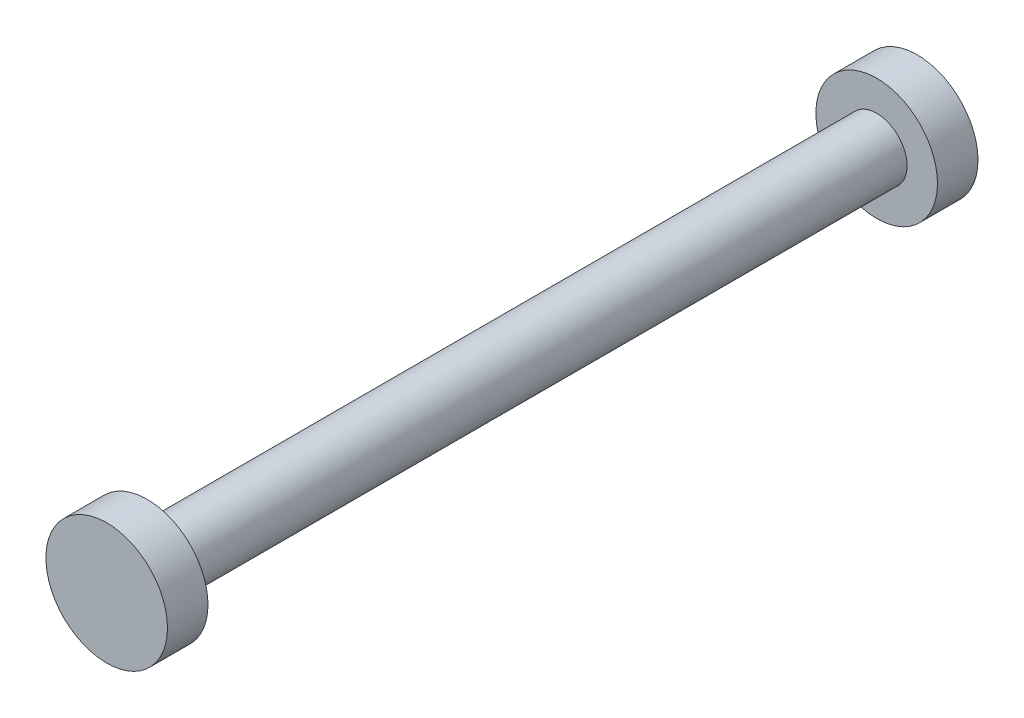
ISO-10303-21;
HEADER;
FILE_DESCRIPTION(('STEP AP214'),'2;1');
FILE_NAME('part.step','',(''),(''),'','','');
FILE_SCHEMA(('AUTOMOTIVE_DESIGN { 1 0 10303 214 1 1 1 1 }'));
ENDSEC;
DATA;
#1=APPLICATION_CONTEXT('core data for automotive mechanical design processes');
#2=APPLICATION_PROTOCOL_DEFINITION('international standard','automotive_design',2000,#1);
#3=PRODUCT_CONTEXT('',#1,'mechanical');
#4=PRODUCT('Part','Part','',(#3));
#5=PRODUCT_RELATED_PRODUCT_CATEGORY('part','',(#4));
#6=PRODUCT_DEFINITION_FORMATION('','',#4);
#7=PRODUCT_DEFINITION_CONTEXT('part definition',#1,'design');
#8=PRODUCT_DEFINITION('design','',#6,#7);
#9=PRODUCT_DEFINITION_SHAPE('','',#8);
#10=(LENGTH_UNIT() NAMED_UNIT(*) SI_UNIT(.MILLI.,.METRE.));
#11=(NAMED_UNIT(*) PLANE_ANGLE_UNIT() SI_UNIT($,.RADIAN.));
#12=(NAMED_UNIT(*) SI_UNIT($,.STERADIAN.) SOLID_ANGLE_UNIT());
#13=UNCERTAINTY_MEASURE_WITH_UNIT(LENGTH_MEASURE(1.E-05),#10,'distance_accuracy_value','');
#14=(GEOMETRIC_REPRESENTATION_CONTEXT(3) GLOBAL_UNCERTAINTY_ASSIGNED_CONTEXT((#13)) GLOBAL_UNIT_ASSIGNED_CONTEXT((#10,
#11,#12)) REPRESENTATION_CONTEXT('',''));
#15=CARTESIAN_POINT('',(0.,0.,0.));
#16=DIRECTION('',(0.,0.,1.));
#17=DIRECTION('',(1.,0.,0.));
#18=AXIS2_PLACEMENT_3D('',#15,#16,#17);
#19=CARTESIAN_POINT('',(0.,0.,45.72));
#20=DIRECTION('',(0.,0.,-1.));
#21=DIRECTION('',(-1.,0.,0.));
#22=AXIS2_PLACEMENT_3D('',#19,#20,#21);
#23=CYLINDRICAL_SURFACE('',#22,1.905);
#24=CARTESIAN_POINT('',(0.,0.,45.72));
#25=DIRECTION('',(0.,0.,1.));
#26=DIRECTION('',(1.,0.,0.));
#27=AXIS2_PLACEMENT_3D('',#24,#25,#26);
#28=CIRCLE('',#27,1.905);
#29=CARTESIAN_POINT('',(1.905,0.,45.72));
#30=VERTEX_POINT('',#29);
#31=EDGE_CURVE('E10',#30,#30,#28,.T.);
#32=ORIENTED_EDGE('',*,*,#31,.F.);
#33=EDGE_LOOP('',(#32));
#34=FACE_BOUND('',#33,.T.);
#35=CARTESIAN_POINT('',(0.,0.,0.));
#36=DIRECTION('',(0.,0.,1.));
#37=DIRECTION('',(1.,0.,0.));
#38=AXIS2_PLACEMENT_3D('',#35,#36,#37);
#39=CIRCLE('',#38,1.905);
#40=CARTESIAN_POINT('',(1.905,0.,0.));
#41=VERTEX_POINT('',#40);
#42=EDGE_CURVE('E40',#41,#41,#39,.T.);
#43=ORIENTED_EDGE('',*,*,#42,.T.);
#44=EDGE_LOOP('',(#43));
#45=FACE_BOUND('',#44,.T.);
#46=ADVANCED_FACE('F37',(#34,#45),#23,.T.);
#47=CARTESIAN_POINT('',(0.,0.,48.26));
#48=DIRECTION('',(0.,0.,-1.));
#49=DIRECTION('',(-1.,0.,0.));
#50=AXIS2_PLACEMENT_3D('',#47,#48,#49);
#51=CYLINDRICAL_SURFACE('',#50,3.81);
#52=CARTESIAN_POINT('',(0.,0.,48.26));
#53=DIRECTION('',(0.,0.,1.));
#54=DIRECTION('',(1.,0.,0.));
#55=AXIS2_PLACEMENT_3D('',#52,#53,#54);
#56=CIRCLE('',#55,3.81);
#57=CARTESIAN_POINT('',(3.81,0.,48.26));
#58=VERTEX_POINT('',#57);
#59=EDGE_CURVE('E45',#58,#58,#56,.T.);
#60=ORIENTED_EDGE('',*,*,#59,.F.);
#61=EDGE_LOOP('',(#60));
#62=FACE_BOUND('',#61,.T.);
#63=CARTESIAN_POINT('',(0.,0.,45.72));
#64=DIRECTION('',(0.,0.,1.));
#65=DIRECTION('',(1.,0.,0.));
#66=AXIS2_PLACEMENT_3D('',#63,#64,#65);
#67=CIRCLE('',#66,3.81);
#68=CARTESIAN_POINT('',(3.81,0.,45.72));
#69=VERTEX_POINT('',#68);
#70=EDGE_CURVE('E50',#69,#69,#67,.T.);
#71=ORIENTED_EDGE('',*,*,#70,.T.);
#72=EDGE_LOOP('',(#71));
#73=FACE_BOUND('',#72,.T.);
#74=ADVANCED_FACE('F91',(#62,#73),#51,.T.);
#75=CARTESIAN_POINT('',(0.,0.,48.26));
#76=DIRECTION('',(0.,0.,1.));
#77=DIRECTION('',(1.,0.,0.));
#78=AXIS2_PLACEMENT_3D('',#75,#76,#77);
#79=PLANE('',#78);
#80=ORIENTED_EDGE('',*,*,#59,.T.);
#81=EDGE_LOOP('',(#80));
#82=FACE_BOUND('',#81,.T.);
#83=ADVANCED_FACE('F87',(#82),#79,.T.);
#84=CARTESIAN_POINT('',(0.,0.,45.72));
#85=DIRECTION('',(0.,0.,1.));
#86=DIRECTION('',(1.,0.,0.));
#87=AXIS2_PLACEMENT_3D('',#84,#85,#86);
#88=PLANE('',#87);
#89=ORIENTED_EDGE('',*,*,#31,.T.);
#90=EDGE_LOOP('',(#89));
#91=FACE_BOUND('',#90,.T.);
#92=ORIENTED_EDGE('',*,*,#70,.F.);
#93=EDGE_LOOP('',(#92));
#94=FACE_BOUND('',#93,.T.);
#95=ADVANCED_FACE('F79',(#91,#94),#88,.F.);
#96=CARTESIAN_POINT('',(0.,0.,-2.54));
#97=DIRECTION('',(0.,0.,1.));
#98=DIRECTION('',(1.,0.,0.));
#99=AXIS2_PLACEMENT_3D('',#96,#97,#98);
#100=CYLINDRICAL_SURFACE('',#99,3.81);
#101=CARTESIAN_POINT('',(0.,0.,-2.54));
#102=DIRECTION('',(0.,0.,1.));
#103=DIRECTION('',(1.,0.,0.));
#104=AXIS2_PLACEMENT_3D('',#101,#102,#103);
#105=CIRCLE('',#104,3.81);
#106=CARTESIAN_POINT('',(3.81,0.,-2.54));
#107=VERTEX_POINT('',#106);
#108=EDGE_CURVE('E60',#107,#107,#105,.T.);
#109=ORIENTED_EDGE('',*,*,#108,.T.);
#110=EDGE_LOOP('',(#109));
#111=FACE_BOUND('',#110,.T.);
#112=CARTESIAN_POINT('',(0.,0.,0.));
#113=DIRECTION('',(0.,0.,1.));
#114=DIRECTION('',(1.,0.,0.));
#115=AXIS2_PLACEMENT_3D('',#112,#113,#114);
#116=CIRCLE('',#115,3.81);
#117=CARTESIAN_POINT('',(3.81,0.,0.));
#118=VERTEX_POINT('',#117);
#119=EDGE_CURVE('E56',#118,#118,#116,.T.);
#120=ORIENTED_EDGE('',*,*,#119,.F.);
#121=EDGE_LOOP('',(#120));
#122=FACE_BOUND('',#121,.T.);
#123=ADVANCED_FACE('F77',(#111,#122),#100,.T.);
#124=CARTESIAN_POINT('',(0.,0.,-2.54));
#125=DIRECTION('',(0.,0.,-1.));
#126=DIRECTION('',(1.,0.,0.));
#127=AXIS2_PLACEMENT_3D('',#124,#125,#126);
#128=PLANE('',#127);
#129=ORIENTED_EDGE('',*,*,#108,.F.);
#130=EDGE_LOOP('',(#129));
#131=FACE_BOUND('',#130,.T.);
#132=ADVANCED_FACE('F73',(#131),#128,.T.);
#133=CARTESIAN_POINT('',(0.,0.,0.));
#134=DIRECTION('',(0.,0.,-1.));
#135=DIRECTION('',(1.,0.,0.));
#136=AXIS2_PLACEMENT_3D('',#133,#134,#135);
#137=PLANE('',#136);
#138=ORIENTED_EDGE('',*,*,#42,.F.);
#139=EDGE_LOOP('',(#138));
#140=FACE_BOUND('',#139,.T.);
#141=ORIENTED_EDGE('',*,*,#119,.T.);
#142=EDGE_LOOP('',(#141));
#143=FACE_BOUND('',#142,.T.);
#144=ADVANCED_FACE('F70',(#140,#143),#137,.F.);
#145=CLOSED_SHELL('',(#46,#74,#83,#95,#123,#132,#144));
#146=MANIFOLD_SOLID_BREP('B2',#145);
#147=ADVANCED_BREP_SHAPE_REPRESENTATION('',(#18,#146),#14);
#148=SHAPE_DEFINITION_REPRESENTATION(#9,#147);
ENDSEC;
END-ISO-10303-21;
